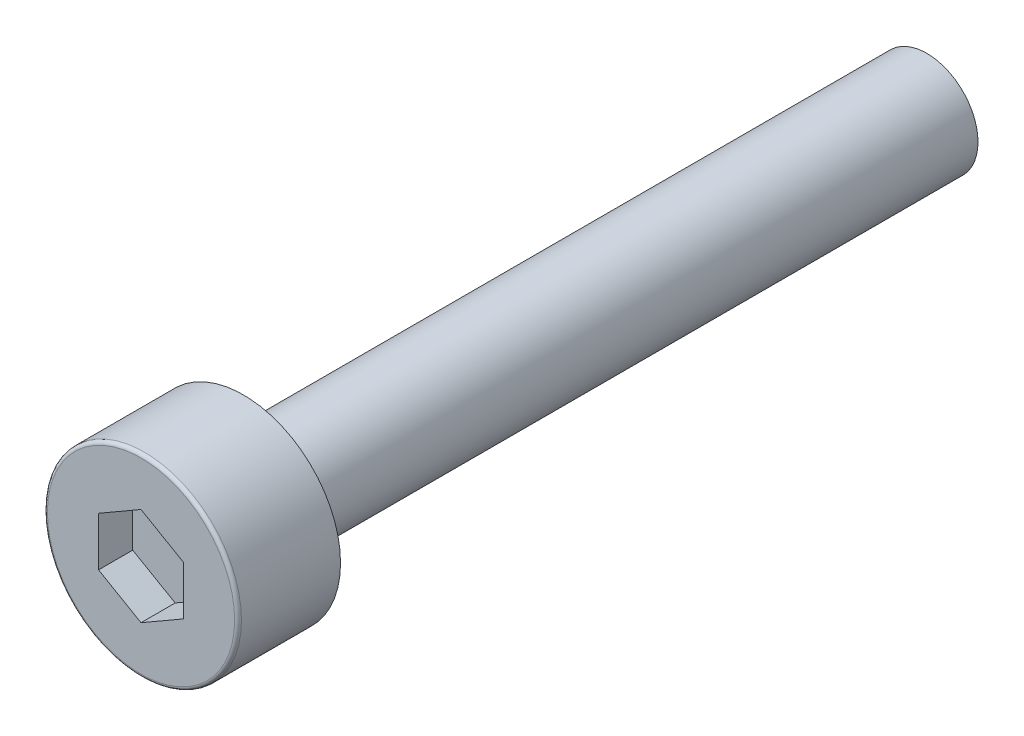
ISO-10303-21;
HEADER;
FILE_DESCRIPTION(('STEP AP214'),'2;1');
FILE_NAME('part.step','',(''),(''),'','','');
FILE_SCHEMA(('AUTOMOTIVE_DESIGN { 1 0 10303 214 1 1 1 1 }'));
ENDSEC;
DATA;
#1=APPLICATION_CONTEXT('core data for automotive mechanical design processes');
#2=APPLICATION_PROTOCOL_DEFINITION('international standard','automotive_design',2000,#1);
#3=PRODUCT_CONTEXT('',#1,'mechanical');
#4=PRODUCT('Part','Part','',(#3));
#5=PRODUCT_RELATED_PRODUCT_CATEGORY('part','',(#4));
#6=PRODUCT_DEFINITION_FORMATION('','',#4);
#7=PRODUCT_DEFINITION_CONTEXT('part definition',#1,'design');
#8=PRODUCT_DEFINITION('design','',#6,#7);
#9=PRODUCT_DEFINITION_SHAPE('','',#8);
#10=(LENGTH_UNIT() NAMED_UNIT(*) SI_UNIT(.MILLI.,.METRE.));
#11=(NAMED_UNIT(*) PLANE_ANGLE_UNIT() SI_UNIT($,.RADIAN.));
#12=(NAMED_UNIT(*) SI_UNIT($,.STERADIAN.) SOLID_ANGLE_UNIT());
#13=UNCERTAINTY_MEASURE_WITH_UNIT(LENGTH_MEASURE(1.E-05),#10,'distance_accuracy_value','');
#14=(GEOMETRIC_REPRESENTATION_CONTEXT(3) GLOBAL_UNCERTAINTY_ASSIGNED_CONTEXT((#13)) GLOBAL_UNIT_ASSIGNED_CONTEXT((#10,
#11,#12)) REPRESENTATION_CONTEXT('',''));
#15=CARTESIAN_POINT('',(0.,0.,0.));
#16=DIRECTION('',(0.,0.,1.));
#17=DIRECTION('',(1.,0.,0.));
#18=AXIS2_PLACEMENT_3D('',#15,#16,#17);
#19=CARTESIAN_POINT('',(0.,0.,2.));
#20=DIRECTION('',(0.,0.,1.));
#21=DIRECTION('',(1.,0.,0.));
#22=AXIS2_PLACEMENT_3D('',#19,#20,#21);
#23=PLANE('',#22);
#24=DIRECTION('',(-0.866025403784439,-0.5,0.));
#25=VECTOR('',#24,1.);
#26=CARTESIAN_POINT('',(0.,1.435,2.));
#27=LINE('',#26,#25);
#28=CARTESIAN_POINT('',(0.,1.435,2.));
#29=VERTEX_POINT('',#28);
#30=CARTESIAN_POINT('',(-1.24274645443067,0.7175,2.));
#31=VERTEX_POINT('',#30);
#32=EDGE_CURVE('E61',#29,#31,#27,.T.);
#33=ORIENTED_EDGE('',*,*,#32,.T.);
#34=DIRECTION('',(0.,-1.,0.));
#35=VECTOR('',#34,1.);
#36=CARTESIAN_POINT('',(-1.24274645443067,0.7175,2.));
#37=LINE('',#36,#35);
#38=CARTESIAN_POINT('',(-1.24274645443067,-0.7175,2.));
#39=VERTEX_POINT('',#38);
#40=EDGE_CURVE('E63',#31,#39,#37,.T.);
#41=ORIENTED_EDGE('',*,*,#40,.T.);
#42=DIRECTION('',(0.866025403784439,-0.5,0.));
#43=VECTOR('',#42,1.);
#44=CARTESIAN_POINT('',(-1.24274645443067,-0.7175,2.));
#45=LINE('',#44,#43);
#46=CARTESIAN_POINT('',(0.,-1.435,2.));
#47=VERTEX_POINT('',#46);
#48=EDGE_CURVE('E65',#39,#47,#45,.T.);
#49=ORIENTED_EDGE('',*,*,#48,.T.);
#50=DIRECTION('',(0.866025403784439,0.5,0.));
#51=VECTOR('',#50,1.);
#52=CARTESIAN_POINT('',(0.,-1.435,2.));
#53=LINE('',#52,#51);
#54=CARTESIAN_POINT('',(1.24274645443067,-0.717500000000001,2.));
#55=VERTEX_POINT('',#54);
#56=EDGE_CURVE('E134',#47,#55,#53,.T.);
#57=ORIENTED_EDGE('',*,*,#56,.T.);
#58=DIRECTION('',(0.,1.,0.));
#59=VECTOR('',#58,1.);
#60=CARTESIAN_POINT('',(1.24274645443067,-0.7175,2.));
#61=LINE('',#60,#59);
#62=CARTESIAN_POINT('',(1.24274645443067,0.7175,2.));
#63=VERTEX_POINT('',#62);
#64=EDGE_CURVE('E140',#55,#63,#61,.T.);
#65=ORIENTED_EDGE('',*,*,#64,.T.);
#66=DIRECTION('',(-0.866025403784439,0.5,0.));
#67=VECTOR('',#66,1.);
#68=CARTESIAN_POINT('',(1.24274645443067,0.717500000000001,2.));
#69=LINE('',#68,#67);
#70=EDGE_CURVE('E145',#63,#29,#69,.T.);
#71=ORIENTED_EDGE('',*,*,#70,.T.);
#72=EDGE_LOOP('',(#33,#41,#49,#57,#65,#71));
#73=FACE_BOUND('',#72,.T.);
#74=ADVANCED_FACE('F17',(#73),#23,.T.);
#75=CARTESIAN_POINT('',(-1.24274645443067,-0.7175,2.));
#76=DIRECTION('',(-0.5,-0.866025403784439,0.));
#77=DIRECTION('',(0.866025403784439,-0.5,0.));
#78=AXIS2_PLACEMENT_3D('',#75,#76,#77);
#79=PLANE('',#78);
#80=DIRECTION('',(0.,0.,1.));
#81=VECTOR('',#80,1.);
#82=CARTESIAN_POINT('',(0.,-1.435,2.));
#83=LINE('',#82,#81);
#84=CARTESIAN_POINT('',(0.,-1.435,3.));
#85=VERTEX_POINT('',#84);
#86=EDGE_CURVE('E79',#85,#47,#83,.F.);
#87=ORIENTED_EDGE('',*,*,#86,.T.);
#88=ORIENTED_EDGE('',*,*,#48,.F.);
#89=DIRECTION('',(0.,0.,1.));
#90=VECTOR('',#89,1.);
#91=CARTESIAN_POINT('',(-1.24274645443067,-0.7175,2.));
#92=LINE('',#91,#90);
#93=CARTESIAN_POINT('',(-1.24274645443067,-0.7175,3.));
#94=VERTEX_POINT('',#93);
#95=EDGE_CURVE('E71',#39,#94,#92,.T.);
#96=ORIENTED_EDGE('',*,*,#95,.T.);
#97=DIRECTION('',(-0.866025403784438,0.5,0.));
#98=VECTOR('',#97,1.);
#99=CARTESIAN_POINT('',(0.,-1.435,3.));
#100=LINE('',#99,#98);
#101=EDGE_CURVE('E133',#85,#94,#100,.T.);
#102=ORIENTED_EDGE('',*,*,#101,.F.);
#103=EDGE_LOOP('',(#87,#88,#96,#102));
#104=FACE_BOUND('',#103,.T.);
#105=ADVANCED_FACE('F75',(#104),#79,.F.);
#106=CARTESIAN_POINT('',(-1.24274645443067,0.7175,2.));
#107=DIRECTION('',(-1.,0.,0.));
#108=DIRECTION('',(0.,-1.,0.));
#109=AXIS2_PLACEMENT_3D('',#106,#107,#108);
#110=PLANE('',#109);
#111=ORIENTED_EDGE('',*,*,#95,.F.);
#112=ORIENTED_EDGE('',*,*,#40,.F.);
#113=DIRECTION('',(0.,0.,1.));
#114=VECTOR('',#113,1.);
#115=CARTESIAN_POINT('',(-1.24274645443067,0.7175,2.));
#116=LINE('',#115,#114);
#117=CARTESIAN_POINT('',(-1.24274645443067,0.7175,3.));
#118=VERTEX_POINT('',#117);
#119=EDGE_CURVE('E87',#31,#118,#116,.T.);
#120=ORIENTED_EDGE('',*,*,#119,.T.);
#121=DIRECTION('',(0.,1.,0.));
#122=VECTOR('',#121,1.);
#123=CARTESIAN_POINT('',(-1.24274645443067,0.,3.));
#124=LINE('',#123,#122);
#125=EDGE_CURVE('E84',#94,#118,#124,.T.);
#126=ORIENTED_EDGE('',*,*,#125,.F.);
#127=EDGE_LOOP('',(#111,#112,#120,#126));
#128=FACE_BOUND('',#127,.T.);
#129=ADVANCED_FACE('F82',(#128),#110,.F.);
#130=CARTESIAN_POINT('',(0.,1.435,2.));
#131=DIRECTION('',(-0.5,0.866025403784439,0.));
#132=DIRECTION('',(-0.866025403784439,-0.5,0.));
#133=AXIS2_PLACEMENT_3D('',#130,#131,#132);
#134=PLANE('',#133);
#135=ORIENTED_EDGE('',*,*,#119,.F.);
#136=ORIENTED_EDGE('',*,*,#32,.F.);
#137=DIRECTION('',(0.,0.,1.));
#138=VECTOR('',#137,1.);
#139=CARTESIAN_POINT('',(0.,1.435,2.));
#140=LINE('',#139,#138);
#141=CARTESIAN_POINT('',(0.,1.435,3.));
#142=VERTEX_POINT('',#141);
#143=EDGE_CURVE('E142',#29,#142,#140,.T.);
#144=ORIENTED_EDGE('',*,*,#143,.T.);
#145=DIRECTION('',(0.866025403784439,0.5,0.));
#146=VECTOR('',#145,1.);
#147=CARTESIAN_POINT('',(-1.24274645443067,0.7175,3.));
#148=LINE('',#147,#146);
#149=EDGE_CURVE('E152',#118,#142,#148,.T.);
#150=ORIENTED_EDGE('',*,*,#149,.F.);
#151=EDGE_LOOP('',(#135,#136,#144,#150));
#152=FACE_BOUND('',#151,.T.);
#153=ADVANCED_FACE('F153',(#152),#134,.F.);
#154=CARTESIAN_POINT('',(1.24274645443067,0.717500000000001,2.));
#155=DIRECTION('',(0.5,0.866025403784439,0.));
#156=DIRECTION('',(-0.866025403784439,0.5,0.));
#157=AXIS2_PLACEMENT_3D('',#154,#155,#156);
#158=PLANE('',#157);
#159=ORIENTED_EDGE('',*,*,#143,.F.);
#160=ORIENTED_EDGE('',*,*,#70,.F.);
#161=DIRECTION('',(0.,0.,1.));
#162=VECTOR('',#161,1.);
#163=CARTESIAN_POINT('',(1.24274645443067,0.717500000000001,2.));
#164=LINE('',#163,#162);
#165=CARTESIAN_POINT('',(1.24274645443067,0.717500000000001,3.));
#166=VERTEX_POINT('',#165);
#167=EDGE_CURVE('E137',#63,#166,#164,.T.);
#168=ORIENTED_EDGE('',*,*,#167,.T.);
#169=DIRECTION('',(0.866025403784439,-0.5,0.));
#170=VECTOR('',#169,1.);
#171=CARTESIAN_POINT('',(0.,1.435,3.));
#172=LINE('',#171,#170);
#173=EDGE_CURVE('E158',#142,#166,#172,.T.);
#174=ORIENTED_EDGE('',*,*,#173,.F.);
#175=EDGE_LOOP('',(#159,#160,#168,#174));
#176=FACE_BOUND('',#175,.T.);
#177=ADVANCED_FACE('F241',(#176),#158,.F.);
#178=CARTESIAN_POINT('',(1.24274645443067,-0.7175,2.));
#179=DIRECTION('',(1.,0.,0.));
#180=DIRECTION('',(0.,1.,0.));
#181=AXIS2_PLACEMENT_3D('',#178,#179,#180);
#182=PLANE('',#181);
#183=ORIENTED_EDGE('',*,*,#167,.F.);
#184=ORIENTED_EDGE('',*,*,#64,.F.);
#185=DIRECTION('',(0.,0.,1.));
#186=VECTOR('',#185,1.);
#187=CARTESIAN_POINT('',(1.24274645443067,-0.717500000000001,2.));
#188=LINE('',#187,#186);
#189=CARTESIAN_POINT('',(1.24274645443067,-0.717500000000001,3.));
#190=VERTEX_POINT('',#189);
#191=EDGE_CURVE('E125',#55,#190,#188,.T.);
#192=ORIENTED_EDGE('',*,*,#191,.T.);
#193=DIRECTION('',(0.,1.,0.));
#194=VECTOR('',#193,1.);
#195=CARTESIAN_POINT('',(1.24274645443067,0.,3.));
#196=LINE('',#195,#194);
#197=EDGE_CURVE('E166',#166,#190,#196,.F.);
#198=ORIENTED_EDGE('',*,*,#197,.F.);
#199=EDGE_LOOP('',(#183,#184,#192,#198));
#200=FACE_BOUND('',#199,.T.);
#201=ADVANCED_FACE('F191',(#200),#182,.F.);
#202=CARTESIAN_POINT('',(0.,-1.435,2.));
#203=DIRECTION('',(0.5,-0.866025403784439,0.));
#204=DIRECTION('',(0.866025403784439,0.5,0.));
#205=AXIS2_PLACEMENT_3D('',#202,#203,#204);
#206=PLANE('',#205);
#207=ORIENTED_EDGE('',*,*,#191,.F.);
#208=ORIENTED_EDGE('',*,*,#56,.F.);
#209=ORIENTED_EDGE('',*,*,#86,.F.);
#210=DIRECTION('',(-0.866025403784439,-0.5,0.));
#211=VECTOR('',#210,1.);
#212=CARTESIAN_POINT('',(1.24274645443067,-0.7175,3.));
#213=LINE('',#212,#211);
#214=EDGE_CURVE('E168',#190,#85,#213,.T.);
#215=ORIENTED_EDGE('',*,*,#214,.F.);
#216=EDGE_LOOP('',(#207,#208,#209,#215));
#217=FACE_BOUND('',#216,.T.);
#218=ADVANCED_FACE('F186',(#217),#206,.F.);
#219=CARTESIAN_POINT('',(0.,0.,3.));
#220=DIRECTION('',(0.,0.,1.));
#221=DIRECTION('',(1.,0.,0.));
#222=AXIS2_PLACEMENT_3D('',#219,#220,#221);
#223=PLANE('',#222);
#224=ORIENTED_EDGE('',*,*,#197,.T.);
#225=ORIENTED_EDGE('',*,*,#214,.T.);
#226=ORIENTED_EDGE('',*,*,#101,.T.);
#227=ORIENTED_EDGE('',*,*,#125,.T.);
#228=ORIENTED_EDGE('',*,*,#149,.T.);
#229=ORIENTED_EDGE('',*,*,#173,.T.);
#230=EDGE_LOOP('',(#224,#225,#226,#227,#228,#229));
#231=FACE_BOUND('',#230,.T.);
#232=CARTESIAN_POINT('',(0.,0.,3.));
#233=DIRECTION('',(0.,0.,-1.));
#234=DIRECTION('',(-1.,0.,0.));
#235=AXIS2_PLACEMENT_3D('',#232,#233,#234);
#236=CIRCLE('',#235,2.74);
#237=CARTESIAN_POINT('',(-2.74,0.,3.));
#238=VERTEX_POINT('',#237);
#239=CARTESIAN_POINT('',(2.74,0.,3.));
#240=VERTEX_POINT('',#239);
#241=EDGE_CURVE('E36',#238,#240,#236,.T.);
#242=ORIENTED_EDGE('',*,*,#241,.F.);
#243=CARTESIAN_POINT('',(0.,0.,3.));
#244=DIRECTION('',(0.,0.,-1.));
#245=DIRECTION('',(1.,0.,0.));
#246=AXIS2_PLACEMENT_3D('',#243,#244,#245);
#247=CIRCLE('',#246,2.74);
#248=EDGE_CURVE('E99',#240,#238,#247,.T.);
#249=ORIENTED_EDGE('',*,*,#248,.F.);
#250=EDGE_LOOP('',(#242,#249));
#251=FACE_BOUND('',#250,.T.);
#252=ADVANCED_FACE('F113',(#231,#251),#223,.T.);
#253=CARTESIAN_POINT('',(0.,0.,2.9));
#254=DIRECTION('',(0.,0.,1.));
#255=DIRECTION('',(1.,0.,0.));
#256=AXIS2_PLACEMENT_3D('',#253,#254,#255);
#257=TOROIDAL_SURFACE('',#256,2.74,0.1);
#258=CARTESIAN_POINT('',(0.,0.,2.9));
#259=DIRECTION('',(0.,0.,-1.));
#260=DIRECTION('',(-1.,0.,0.));
#261=AXIS2_PLACEMENT_3D('',#258,#259,#260);
#262=CIRCLE('',#261,2.84);
#263=CARTESIAN_POINT('',(-2.84,0.,2.9));
#264=VERTEX_POINT('',#263);
#265=EDGE_CURVE('E95',#264,#264,#262,.T.);
#266=ORIENTED_EDGE('',*,*,#265,.F.);
#267=EDGE_LOOP('',(#266));
#268=FACE_BOUND('',#267,.T.);
#269=ORIENTED_EDGE('',*,*,#248,.T.);
#270=ORIENTED_EDGE('',*,*,#241,.T.);
#271=EDGE_LOOP('',(#269,#270));
#272=FACE_BOUND('',#271,.T.);
#273=ADVANCED_FACE('F107',(#268,#272),#257,.T.);
#274=CARTESIAN_POINT('',(0.,0.,3.));
#275=DIRECTION('',(0.,0.,-1.));
#276=DIRECTION('',(-1.,0.,0.));
#277=AXIS2_PLACEMENT_3D('',#274,#275,#276);
#278=CYLINDRICAL_SURFACE('',#277,2.84);
#279=ORIENTED_EDGE('',*,*,#265,.T.);
#280=EDGE_LOOP('',(#279));
#281=FACE_BOUND('',#280,.T.);
#282=CARTESIAN_POINT('',(0.,0.,0.));
#283=DIRECTION('',(0.,0.,-1.));
#284=DIRECTION('',(-1.,0.,0.));
#285=AXIS2_PLACEMENT_3D('',#282,#283,#284);
#286=CIRCLE('',#285,2.84);
#287=CARTESIAN_POINT('',(-2.84,0.,0.));
#288=VERTEX_POINT('',#287);
#289=EDGE_CURVE('E93',#288,#288,#286,.F.);
#290=ORIENTED_EDGE('',*,*,#289,.T.);
#291=EDGE_LOOP('',(#290));
#292=FACE_BOUND('',#291,.T.);
#293=ADVANCED_FACE('F112',(#281,#292),#278,.T.);
#294=CARTESIAN_POINT('',(0.,0.,-20.));
#295=DIRECTION('',(0.,0.,-1.));
#296=DIRECTION('',(-1.,0.,0.));
#297=AXIS2_PLACEMENT_3D('',#294,#295,#296);
#298=PLANE('',#297);
#299=CARTESIAN_POINT('',(0.,0.,-20.));
#300=DIRECTION('',(0.,0.,1.));
#301=DIRECTION('',(1.,0.,0.));
#302=AXIS2_PLACEMENT_3D('',#299,#300,#301);
#303=CIRCLE('',#302,1.5);
#304=CARTESIAN_POINT('',(1.5,0.,-20.));
#305=VERTEX_POINT('',#304);
#306=EDGE_CURVE('E28',#305,#305,#303,.T.);
#307=ORIENTED_EDGE('',*,*,#306,.F.);
#308=EDGE_LOOP('',(#307));
#309=FACE_BOUND('',#308,.T.);
#310=ADVANCED_FACE('F201',(#309),#298,.T.);
#311=CARTESIAN_POINT('',(0.,0.,0.));
#312=DIRECTION('',(0.,0.,1.));
#313=DIRECTION('',(1.,0.,0.));
#314=AXIS2_PLACEMENT_3D('',#311,#312,#313);
#315=PLANE('',#314);
#316=CARTESIAN_POINT('',(0.,0.,0.));
#317=DIRECTION('',(0.,0.,1.));
#318=DIRECTION('',(1.,0.,0.));
#319=AXIS2_PLACEMENT_3D('',#316,#317,#318);
#320=CIRCLE('',#319,1.5);
#321=CARTESIAN_POINT('',(1.5,0.,0.));
#322=VERTEX_POINT('',#321);
#323=EDGE_CURVE('E11',#322,#322,#320,.F.);
#324=ORIENTED_EDGE('',*,*,#323,.F.);
#325=EDGE_LOOP('',(#324));
#326=FACE_BOUND('',#325,.T.);
#327=ORIENTED_EDGE('',*,*,#289,.F.);
#328=EDGE_LOOP('',(#327));
#329=FACE_BOUND('',#328,.T.);
#330=ADVANCED_FACE('F195',(#326,#329),#315,.F.);
#331=CARTESIAN_POINT('',(0.,0.,-20.));
#332=DIRECTION('',(0.,0.,1.));
#333=DIRECTION('',(1.,0.,0.));
#334=AXIS2_PLACEMENT_3D('',#331,#332,#333);
#335=CYLINDRICAL_SURFACE('',#334,1.5);
#336=ORIENTED_EDGE('',*,*,#323,.T.);
#337=EDGE_LOOP('',(#336));
#338=FACE_BOUND('',#337,.T.);
#339=ORIENTED_EDGE('',*,*,#306,.T.);
#340=EDGE_LOOP('',(#339));
#341=FACE_BOUND('',#340,.T.);
#342=ADVANCED_FACE('F193',(#338,#341),#335,.T.);
#343=CLOSED_SHELL('',(#74,#105,#129,#153,#177,#201,#218,#252,#273,#293,#310,#330,#342));
#344=MANIFOLD_SOLID_BREP('B1',#343);
#345=ADVANCED_BREP_SHAPE_REPRESENTATION('',(#18,#344),#14);
#346=SHAPE_DEFINITION_REPRESENTATION(#9,#345);
ENDSEC;
END-ISO-10303-21;
